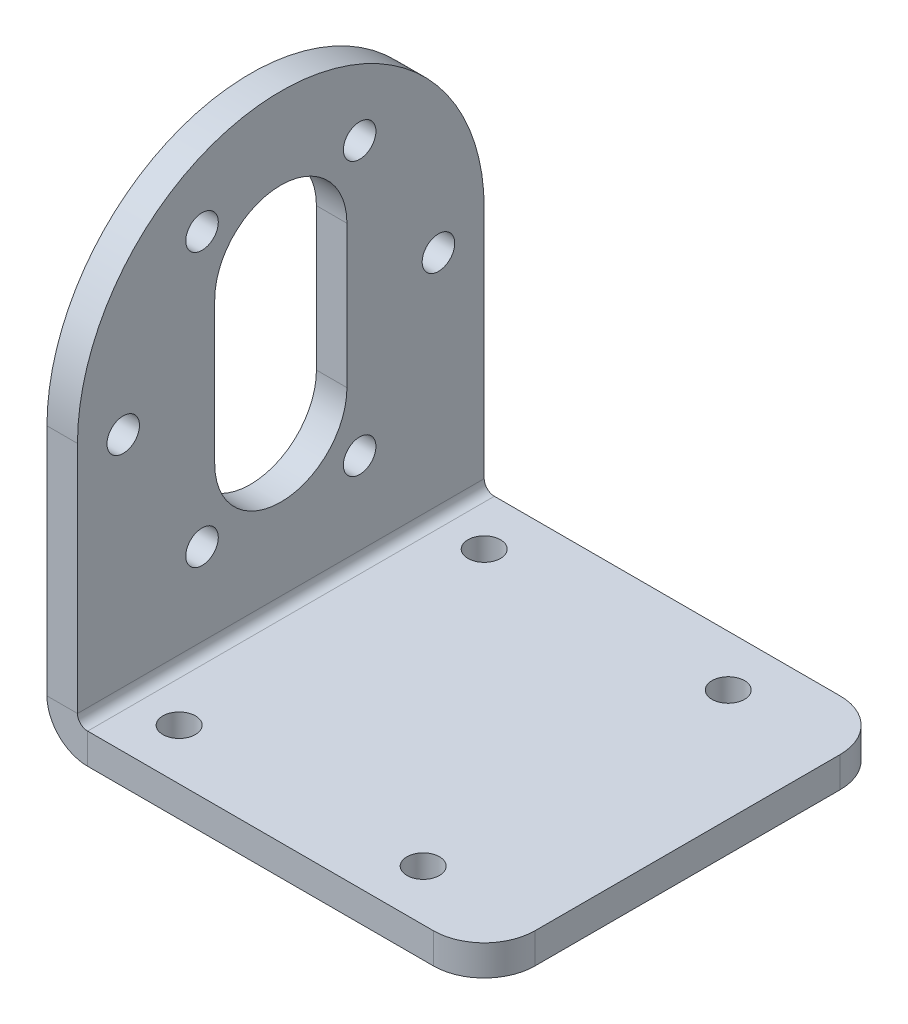
ISO-10303-21;
HEADER;
FILE_DESCRIPTION(('STEP AP214'),'2;1');
FILE_NAME('part.step','',(''),(''),'','','');
FILE_SCHEMA(('AUTOMOTIVE_DESIGN { 1 0 10303 214 1 1 1 1 }'));
ENDSEC;
DATA;
#1=APPLICATION_CONTEXT('core data for automotive mechanical design processes');
#2=APPLICATION_PROTOCOL_DEFINITION('international standard','automotive_design',2000,#1);
#3=PRODUCT_CONTEXT('',#1,'mechanical');
#4=PRODUCT('Part','Part','',(#3));
#5=PRODUCT_RELATED_PRODUCT_CATEGORY('part','',(#4));
#6=PRODUCT_DEFINITION_FORMATION('','',#4);
#7=PRODUCT_DEFINITION_CONTEXT('part definition',#1,'design');
#8=PRODUCT_DEFINITION('design','',#6,#7);
#9=PRODUCT_DEFINITION_SHAPE('','',#8);
#10=(LENGTH_UNIT() NAMED_UNIT(*) SI_UNIT(.MILLI.,.METRE.));
#11=(NAMED_UNIT(*) PLANE_ANGLE_UNIT() SI_UNIT($,.RADIAN.));
#12=(NAMED_UNIT(*) SI_UNIT($,.STERADIAN.) SOLID_ANGLE_UNIT());
#13=UNCERTAINTY_MEASURE_WITH_UNIT(LENGTH_MEASURE(1.E-05),#10,'distance_accuracy_value','');
#14=(GEOMETRIC_REPRESENTATION_CONTEXT(3) GLOBAL_UNCERTAINTY_ASSIGNED_CONTEXT((#13)) GLOBAL_UNIT_ASSIGNED_CONTEXT((#10,
#11,#12)) REPRESENTATION_CONTEXT('',''));
#15=CARTESIAN_POINT('',(0.,0.,0.));
#16=DIRECTION('',(0.,0.,1.));
#17=DIRECTION('',(1.,0.,0.));
#18=AXIS2_PLACEMENT_3D('',#15,#16,#17);
#19=CARTESIAN_POINT('',(7.99999999999999,47.,5.));
#20=DIRECTION('',(0.,-1.,0.));
#21=DIRECTION('',(0.,0.,-1.));
#22=AXIS2_PLACEMENT_3D('',#19,#20,#21);
#23=CYLINDRICAL_SURFACE('',#22,1.6);
#24=CARTESIAN_POINT('',(7.99999999999999,3.,5.));
#25=DIRECTION('',(0.,1.,0.));
#26=DIRECTION('',(0.,0.,1.));
#27=AXIS2_PLACEMENT_3D('',#24,#25,#26);
#28=CIRCLE('',#27,1.6);
#29=CARTESIAN_POINT('',(7.99999999999999,3.,6.6));
#30=VERTEX_POINT('',#29);
#31=EDGE_CURVE('E262',#30,#30,#28,.T.);
#32=ORIENTED_EDGE('',*,*,#31,.T.);
#33=EDGE_LOOP('',(#32));
#34=FACE_BOUND('',#33,.T.);
#35=CARTESIAN_POINT('',(7.99999999999999,0.,5.));
#36=DIRECTION('',(0.,-1.,0.));
#37=DIRECTION('',(0.,0.,-1.));
#38=AXIS2_PLACEMENT_3D('',#35,#36,#37);
#39=CIRCLE('',#38,1.6);
#40=CARTESIAN_POINT('',(7.99999999999999,0.,3.40000000000001));
#41=VERTEX_POINT('',#40);
#42=EDGE_CURVE('E265',#41,#41,#39,.T.);
#43=ORIENTED_EDGE('',*,*,#42,.T.);
#44=EDGE_LOOP('',(#43));
#45=FACE_BOUND('',#44,.T.);
#46=ADVANCED_FACE('F40',(#34,#45),#23,.F.);
#47=CARTESIAN_POINT('',(7.99999999999999,47.,35.));
#48=DIRECTION('',(0.,-1.,0.));
#49=DIRECTION('',(0.,0.,-1.));
#50=AXIS2_PLACEMENT_3D('',#47,#48,#49);
#51=CYLINDRICAL_SURFACE('',#50,1.6);
#52=CARTESIAN_POINT('',(7.99999999999999,3.,35.));
#53=DIRECTION('',(0.,1.,0.));
#54=DIRECTION('',(0.,0.,1.));
#55=AXIS2_PLACEMENT_3D('',#52,#53,#54);
#56=CIRCLE('',#55,1.6);
#57=CARTESIAN_POINT('',(7.99999999999999,3.,36.6));
#58=VERTEX_POINT('',#57);
#59=EDGE_CURVE('E251',#58,#58,#56,.T.);
#60=ORIENTED_EDGE('',*,*,#59,.T.);
#61=EDGE_LOOP('',(#60));
#62=FACE_BOUND('',#61,.T.);
#63=CARTESIAN_POINT('',(7.99999999999999,0.,35.));
#64=DIRECTION('',(0.,-1.,0.));
#65=DIRECTION('',(0.,0.,-1.));
#66=AXIS2_PLACEMENT_3D('',#63,#64,#65);
#67=CIRCLE('',#66,1.6);
#68=CARTESIAN_POINT('',(7.99999999999999,0.,33.4));
#69=VERTEX_POINT('',#68);
#70=EDGE_CURVE('E259',#69,#69,#67,.T.);
#71=ORIENTED_EDGE('',*,*,#70,.T.);
#72=EDGE_LOOP('',(#71));
#73=FACE_BOUND('',#72,.T.);
#74=ADVANCED_FACE('F346',(#62,#73),#51,.F.);
#75=CARTESIAN_POINT('',(3.,0.,40.));
#76=DIRECTION('',(1.,0.,0.));
#77=DIRECTION('',(0.,0.,-1.));
#78=AXIS2_PLACEMENT_3D('',#75,#76,#77);
#79=PLANE('',#78);
#80=CARTESIAN_POINT('',(3.,25.5,4.50000000000001));
#81=DIRECTION('',(1.,0.,0.));
#82=DIRECTION('',(0.,0.,-1.));
#83=AXIS2_PLACEMENT_3D('',#80,#81,#82);
#84=CIRCLE('',#83,1.6);
#85=CARTESIAN_POINT('',(3.,25.5,2.90000000000001));
#86=VERTEX_POINT('',#85);
#87=EDGE_CURVE('E707',#86,#86,#84,.T.);
#88=ORIENTED_EDGE('',*,*,#87,.F.);
#89=EDGE_LOOP('',(#88));
#90=FACE_BOUND('',#89,.T.);
#91=CARTESIAN_POINT('',(3.,38.9233937586588,12.25));
#92=DIRECTION('',(1.,0.,0.));
#93=DIRECTION('',(0.,0.,-1.));
#94=AXIS2_PLACEMENT_3D('',#91,#92,#93);
#95=CIRCLE('',#94,1.59999999999995);
#96=CARTESIAN_POINT('',(3.,38.9233937586588,10.6500000000001));
#97=VERTEX_POINT('',#96);
#98=EDGE_CURVE('E704',#97,#97,#95,.T.);
#99=ORIENTED_EDGE('',*,*,#98,.F.);
#100=EDGE_LOOP('',(#99));
#101=FACE_BOUND('',#100,.T.);
#102=CARTESIAN_POINT('',(3.,38.9233937586588,27.75));
#103=DIRECTION('',(1.,0.,0.));
#104=DIRECTION('',(0.,0.,-1.));
#105=AXIS2_PLACEMENT_3D('',#102,#103,#104);
#106=CIRCLE('',#105,1.60000000000001);
#107=CARTESIAN_POINT('',(3.,38.9233937586588,26.15));
#108=VERTEX_POINT('',#107);
#109=EDGE_CURVE('E701',#108,#108,#106,.T.);
#110=ORIENTED_EDGE('',*,*,#109,.F.);
#111=EDGE_LOOP('',(#110));
#112=FACE_BOUND('',#111,.T.);
#113=CARTESIAN_POINT('',(3.,25.5,35.5));
#114=DIRECTION('',(1.,0.,0.));
#115=DIRECTION('',(0.,0.,-1.));
#116=AXIS2_PLACEMENT_3D('',#113,#114,#115);
#117=CIRCLE('',#116,1.6);
#118=CARTESIAN_POINT('',(3.,25.5,33.9));
#119=VERTEX_POINT('',#118);
#120=EDGE_CURVE('E698',#119,#119,#117,.T.);
#121=ORIENTED_EDGE('',*,*,#120,.F.);
#122=EDGE_LOOP('',(#121));
#123=FACE_BOUND('',#122,.T.);
#124=CARTESIAN_POINT('',(3.,12.0766062413412,27.75));
#125=DIRECTION('',(1.,0.,0.));
#126=DIRECTION('',(0.,0.,-1.));
#127=AXIS2_PLACEMENT_3D('',#124,#125,#126);
#128=CIRCLE('',#127,1.6);
#129=CARTESIAN_POINT('',(3.,12.0766062413412,26.15));
#130=VERTEX_POINT('',#129);
#131=EDGE_CURVE('E695',#130,#130,#128,.T.);
#132=ORIENTED_EDGE('',*,*,#131,.F.);
#133=EDGE_LOOP('',(#132));
#134=FACE_BOUND('',#133,.T.);
#135=CARTESIAN_POINT('',(3.,12.0766062413412,12.25));
#136=DIRECTION('',(1.,0.,0.));
#137=DIRECTION('',(0.,0.,-1.));
#138=AXIS2_PLACEMENT_3D('',#135,#136,#137);
#139=CIRCLE('',#138,1.6);
#140=CARTESIAN_POINT('',(3.,12.0766062413412,10.65));
#141=VERTEX_POINT('',#140);
#142=EDGE_CURVE('E686',#141,#141,#139,.T.);
#143=ORIENTED_EDGE('',*,*,#142,.F.);
#144=EDGE_LOOP('',(#143));
#145=FACE_BOUND('',#144,.T.);
#146=CARTESIAN_POINT('',(3.,32.5,20.));
#147=DIRECTION('',(1.,0.,0.));
#148=DIRECTION('',(0.,0.,-1.));
#149=AXIS2_PLACEMENT_3D('',#146,#147,#148);
#150=CIRCLE('',#149,6.5);
#151=CARTESIAN_POINT('',(3.,32.5,13.5));
#152=VERTEX_POINT('',#151);
#153=CARTESIAN_POINT('',(3.,32.5,26.5));
#154=VERTEX_POINT('',#153);
#155=EDGE_CURVE('E183',#152,#154,#150,.T.);
#156=ORIENTED_EDGE('',*,*,#155,.F.);
#157=DIRECTION('',(0.,1.,0.));
#158=VECTOR('',#157,1.);
#159=CARTESIAN_POINT('',(3.,0.,13.5));
#160=LINE('',#159,#158);
#161=CARTESIAN_POINT('',(3.,18.5,13.5));
#162=VERTEX_POINT('',#161);
#163=EDGE_CURVE('E176',#162,#152,#160,.T.);
#164=ORIENTED_EDGE('',*,*,#163,.F.);
#165=CARTESIAN_POINT('',(3.,18.5,20.));
#166=DIRECTION('',(1.,0.,0.));
#167=DIRECTION('',(0.,0.,-1.));
#168=AXIS2_PLACEMENT_3D('',#165,#166,#167);
#169=CIRCLE('',#168,6.5);
#170=CARTESIAN_POINT('',(3.,18.5,26.5));
#171=VERTEX_POINT('',#170);
#172=EDGE_CURVE('E151',#171,#162,#169,.T.);
#173=ORIENTED_EDGE('',*,*,#172,.F.);
#174=DIRECTION('',(0.,-1.,0.));
#175=VECTOR('',#174,1.);
#176=CARTESIAN_POINT('',(3.,0.,26.5));
#177=LINE('',#176,#175);
#178=EDGE_CURVE('E181',#154,#171,#177,.T.);
#179=ORIENTED_EDGE('',*,*,#178,.F.);
#180=EDGE_LOOP('',(#156,#164,#173,#179));
#181=FACE_BOUND('',#180,.T.);
#182=CARTESIAN_POINT('',(3.,27.,20.));
#183=DIRECTION('',(1.,0.,0.));
#184=DIRECTION('',(0.,0.,-1.));
#185=AXIS2_PLACEMENT_3D('',#182,#183,#184);
#186=CIRCLE('',#185,20.);
#187=CARTESIAN_POINT('',(3.,27.,40.));
#188=VERTEX_POINT('',#187);
#189=CARTESIAN_POINT('',(3.,27.,0.));
#190=VERTEX_POINT('',#189);
#191=EDGE_CURVE('E190',#188,#190,#186,.F.);
#192=ORIENTED_EDGE('',*,*,#191,.F.);
#193=DIRECTION('',(0.,1.,0.));
#194=VECTOR('',#193,1.);
#195=CARTESIAN_POINT('',(3.,0.,40.));
#196=LINE('',#195,#194);
#197=CARTESIAN_POINT('',(3.,4.,40.));
#198=VERTEX_POINT('',#197);
#199=EDGE_CURVE('E201',#188,#198,#196,.F.);
#200=ORIENTED_EDGE('',*,*,#199,.T.);
#201=DIRECTION('',(0.,0.,-1.));
#202=VECTOR('',#201,1.);
#203=CARTESIAN_POINT('',(3.,4.,40.));
#204=LINE('',#203,#202);
#205=CARTESIAN_POINT('',(3.,4.,0.));
#206=VERTEX_POINT('',#205);
#207=EDGE_CURVE('E228',#198,#206,#204,.T.);
#208=ORIENTED_EDGE('',*,*,#207,.T.);
#209=DIRECTION('',(0.,1.,0.));
#210=VECTOR('',#209,1.);
#211=CARTESIAN_POINT('',(3.,0.,0.));
#212=LINE('',#211,#210);
#213=EDGE_CURVE('E217',#190,#206,#212,.F.);
#214=ORIENTED_EDGE('',*,*,#213,.F.);
#215=EDGE_LOOP('',(#192,#200,#208,#214));
#216=FACE_BOUND('',#215,.T.);
#217=ADVANCED_FACE('F321',(#90,#101,#112,#123,#134,#145,#181,#216),#79,.T.);
#218=CARTESIAN_POINT('',(0.,0.,40.));
#219=DIRECTION('',(1.,0.,0.));
#220=DIRECTION('',(0.,0.,-1.));
#221=AXIS2_PLACEMENT_3D('',#218,#219,#220);
#222=PLANE('',#221);
#223=CARTESIAN_POINT('',(0.,25.5,4.50000000000001));
#224=DIRECTION('',(-1.,0.,0.));
#225=DIRECTION('',(0.,0.,1.));
#226=AXIS2_PLACEMENT_3D('',#223,#224,#225);
#227=CIRCLE('',#226,1.6);
#228=CARTESIAN_POINT('',(0.,25.5,6.10000000000001));
#229=VERTEX_POINT('',#228);
#230=EDGE_CURVE('E665',#229,#229,#227,.T.);
#231=ORIENTED_EDGE('',*,*,#230,.F.);
#232=EDGE_LOOP('',(#231));
#233=FACE_BOUND('',#232,.T.);
#234=CARTESIAN_POINT('',(0.,38.9233937586588,12.25));
#235=DIRECTION('',(-1.,0.,0.));
#236=DIRECTION('',(0.,0.,1.));
#237=AXIS2_PLACEMENT_3D('',#234,#235,#236);
#238=CIRCLE('',#237,1.59999999999995);
#239=CARTESIAN_POINT('',(0.,38.9233937586588,13.85));
#240=VERTEX_POINT('',#239);
#241=EDGE_CURVE('E255',#240,#240,#238,.T.);
#242=ORIENTED_EDGE('',*,*,#241,.F.);
#243=EDGE_LOOP('',(#242));
#244=FACE_BOUND('',#243,.T.);
#245=CARTESIAN_POINT('',(0.,38.9233937586588,27.75));
#246=DIRECTION('',(-1.,0.,0.));
#247=DIRECTION('',(0.,0.,1.));
#248=AXIS2_PLACEMENT_3D('',#245,#246,#247);
#249=CIRCLE('',#248,1.60000000000001);
#250=CARTESIAN_POINT('',(0.,38.9233937586588,29.35));
#251=VERTEX_POINT('',#250);
#252=EDGE_CURVE('E672',#251,#251,#249,.T.);
#253=ORIENTED_EDGE('',*,*,#252,.F.);
#254=EDGE_LOOP('',(#253));
#255=FACE_BOUND('',#254,.T.);
#256=CARTESIAN_POINT('',(0.,25.5,35.5));
#257=DIRECTION('',(-1.,0.,0.));
#258=DIRECTION('',(0.,0.,1.));
#259=AXIS2_PLACEMENT_3D('',#256,#257,#258);
#260=CIRCLE('',#259,1.6);
#261=CARTESIAN_POINT('',(0.,25.5,37.1));
#262=VERTEX_POINT('',#261);
#263=EDGE_CURVE('E676',#262,#262,#260,.T.);
#264=ORIENTED_EDGE('',*,*,#263,.F.);
#265=EDGE_LOOP('',(#264));
#266=FACE_BOUND('',#265,.T.);
#267=CARTESIAN_POINT('',(0.,12.0766062413412,27.75));
#268=DIRECTION('',(-1.,0.,0.));
#269=DIRECTION('',(0.,0.,1.));
#270=AXIS2_PLACEMENT_3D('',#267,#268,#269);
#271=CIRCLE('',#270,1.6);
#272=CARTESIAN_POINT('',(0.,12.0766062413412,29.35));
#273=VERTEX_POINT('',#272);
#274=EDGE_CURVE('E680',#273,#273,#271,.T.);
#275=ORIENTED_EDGE('',*,*,#274,.F.);
#276=EDGE_LOOP('',(#275));
#277=FACE_BOUND('',#276,.T.);
#278=CARTESIAN_POINT('',(0.,12.0766062413412,12.25));
#279=DIRECTION('',(-1.,0.,0.));
#280=DIRECTION('',(0.,0.,1.));
#281=AXIS2_PLACEMENT_3D('',#278,#279,#280);
#282=CIRCLE('',#281,1.6);
#283=CARTESIAN_POINT('',(0.,12.0766062413412,13.85));
#284=VERTEX_POINT('',#283);
#285=EDGE_CURVE('E683',#284,#284,#282,.T.);
#286=ORIENTED_EDGE('',*,*,#285,.F.);
#287=EDGE_LOOP('',(#286));
#288=FACE_BOUND('',#287,.T.);
#289=DIRECTION('',(0.,-1.,0.));
#290=VECTOR('',#289,1.);
#291=CARTESIAN_POINT('',(0.,32.5,13.5));
#292=LINE('',#291,#290);
#293=CARTESIAN_POINT('',(0.,32.5,13.5));
#294=VERTEX_POINT('',#293);
#295=CARTESIAN_POINT('',(0.,18.5,13.5));
#296=VERTEX_POINT('',#295);
#297=EDGE_CURVE('E159',#294,#296,#292,.T.);
#298=ORIENTED_EDGE('',*,*,#297,.F.);
#299=CARTESIAN_POINT('',(0.,32.5,20.));
#300=DIRECTION('',(-1.,0.,0.));
#301=DIRECTION('',(0.,0.,1.));
#302=AXIS2_PLACEMENT_3D('',#299,#300,#301);
#303=CIRCLE('',#302,6.5);
#304=CARTESIAN_POINT('',(0.,32.5,26.5));
#305=VERTEX_POINT('',#304);
#306=EDGE_CURVE('E164',#305,#294,#303,.T.);
#307=ORIENTED_EDGE('',*,*,#306,.F.);
#308=DIRECTION('',(0.,1.,0.));
#309=VECTOR('',#308,1.);
#310=CARTESIAN_POINT('',(0.,32.5,26.5));
#311=LINE('',#310,#309);
#312=CARTESIAN_POINT('',(0.,18.5,26.5));
#313=VERTEX_POINT('',#312);
#314=EDGE_CURVE('E169',#313,#305,#311,.T.);
#315=ORIENTED_EDGE('',*,*,#314,.F.);
#316=CARTESIAN_POINT('',(0.,18.5,20.));
#317=DIRECTION('',(-1.,0.,0.));
#318=DIRECTION('',(0.,0.,1.));
#319=AXIS2_PLACEMENT_3D('',#316,#317,#318);
#320=CIRCLE('',#319,6.5);
#321=EDGE_CURVE('E148',#296,#313,#320,.T.);
#322=ORIENTED_EDGE('',*,*,#321,.F.);
#323=EDGE_LOOP('',(#298,#307,#315,#322));
#324=FACE_BOUND('',#323,.T.);
#325=DIRECTION('',(0.,-1.,0.));
#326=VECTOR('',#325,1.);
#327=CARTESIAN_POINT('',(0.,0.,40.));
#328=LINE('',#327,#326);
#329=CARTESIAN_POINT('',(0.,27.,40.));
#330=VERTEX_POINT('',#329);
#331=CARTESIAN_POINT('',(0.,4.,40.));
#332=VERTEX_POINT('',#331);
#333=EDGE_CURVE('E203',#330,#332,#328,.T.);
#334=ORIENTED_EDGE('',*,*,#333,.F.);
#335=CARTESIAN_POINT('',(0.,27.,20.));
#336=DIRECTION('',(-1.,0.,0.));
#337=DIRECTION('',(0.,0.,1.));
#338=AXIS2_PLACEMENT_3D('',#335,#336,#337);
#339=CIRCLE('',#338,20.);
#340=CARTESIAN_POINT('',(0.,27.,0.));
#341=VERTEX_POINT('',#340);
#342=EDGE_CURVE('E188',#341,#330,#339,.F.);
#343=ORIENTED_EDGE('',*,*,#342,.F.);
#344=DIRECTION('',(0.,-1.,0.));
#345=VECTOR('',#344,1.);
#346=CARTESIAN_POINT('',(0.,0.,0.));
#347=LINE('',#346,#345);
#348=CARTESIAN_POINT('',(0.,4.,0.));
#349=VERTEX_POINT('',#348);
#350=EDGE_CURVE('E219',#341,#349,#347,.T.);
#351=ORIENTED_EDGE('',*,*,#350,.T.);
#352=DIRECTION('',(0.,0.,-1.));
#353=VECTOR('',#352,1.);
#354=CARTESIAN_POINT('',(0.,4.,40.));
#355=LINE('',#354,#353);
#356=EDGE_CURVE('E225',#332,#349,#355,.T.);
#357=ORIENTED_EDGE('',*,*,#356,.F.);
#358=EDGE_LOOP('',(#334,#343,#351,#357));
#359=FACE_BOUND('',#358,.T.);
#360=ADVANCED_FACE('F166',(#233,#244,#255,#266,#277,#288,#324,#359),#222,.F.);
#361=CARTESIAN_POINT('',(0.,4.,40.));
#362=DIRECTION('',(0.,0.,1.));
#363=DIRECTION('',(1.,0.,0.));
#364=AXIS2_PLACEMENT_3D('',#361,#362,#363);
#365=PLANE('',#364);
#366=DIRECTION('',(1.,0.,0.));
#367=VECTOR('',#366,1.);
#368=CARTESIAN_POINT('',(0.,4.,40.));
#369=LINE('',#368,#367);
#370=EDGE_CURVE('E245',#332,#198,#369,.T.);
#371=ORIENTED_EDGE('',*,*,#370,.F.);
#372=CARTESIAN_POINT('',(4.,4.,40.));
#373=DIRECTION('',(0.,0.,-1.));
#374=DIRECTION('',(-1.,0.,0.));
#375=AXIS2_PLACEMENT_3D('',#372,#373,#374);
#376=CIRCLE('',#375,4.);
#377=CARTESIAN_POINT('',(4.,0.,40.));
#378=VERTEX_POINT('',#377);
#379=EDGE_CURVE('E205',#332,#378,#376,.F.);
#380=ORIENTED_EDGE('',*,*,#379,.T.);
#381=DIRECTION('',(0.,-1.,0.));
#382=VECTOR('',#381,1.);
#383=CARTESIAN_POINT('',(4.,3.,40.));
#384=LINE('',#383,#382);
#385=CARTESIAN_POINT('',(4.,3.,40.));
#386=VERTEX_POINT('',#385);
#387=EDGE_CURVE('E243',#386,#378,#384,.T.);
#388=ORIENTED_EDGE('',*,*,#387,.F.);
#389=CARTESIAN_POINT('',(4.,4.,40.));
#390=DIRECTION('',(0.,0.,1.));
#391=DIRECTION('',(1.,0.,0.));
#392=AXIS2_PLACEMENT_3D('',#389,#390,#391);
#393=CIRCLE('',#392,1.);
#394=EDGE_CURVE('E198',#198,#386,#393,.T.);
#395=ORIENTED_EDGE('',*,*,#394,.F.);
#396=EDGE_LOOP('',(#371,#380,#388,#395));
#397=FACE_BOUND('',#396,.T.);
#398=ADVANCED_FACE('F307',(#397),#365,.T.);
#399=CARTESIAN_POINT('',(4.,3.,40.));
#400=DIRECTION('',(0.,0.,1.));
#401=DIRECTION('',(1.,0.,0.));
#402=AXIS2_PLACEMENT_3D('',#399,#400,#401);
#403=PLANE('',#402);
#404=DIRECTION('',(-1.,0.,0.));
#405=VECTOR('',#404,1.);
#406=CARTESIAN_POINT('',(10.,27.,40.));
#407=LINE('',#406,#405);
#408=EDGE_CURVE('E185',#188,#330,#407,.T.);
#409=ORIENTED_EDGE('',*,*,#408,.T.);
#410=ORIENTED_EDGE('',*,*,#333,.T.);
#411=ORIENTED_EDGE('',*,*,#370,.T.);
#412=ORIENTED_EDGE('',*,*,#199,.F.);
#413=EDGE_LOOP('',(#409,#410,#411,#412));
#414=FACE_BOUND('',#413,.T.);
#415=ADVANCED_FACE('F325',(#414),#403,.T.);
#416=CARTESIAN_POINT('',(4.,0.,0.));
#417=DIRECTION('',(0.,0.,-1.));
#418=DIRECTION('',(-1.,0.,0.));
#419=AXIS2_PLACEMENT_3D('',#416,#417,#418);
#420=PLANE('',#419);
#421=DIRECTION('',(0.,1.,0.));
#422=VECTOR('',#421,1.);
#423=CARTESIAN_POINT('',(4.,0.,0.));
#424=LINE('',#423,#422);
#425=CARTESIAN_POINT('',(4.,0.,0.));
#426=VERTEX_POINT('',#425);
#427=CARTESIAN_POINT('',(4.,3.,0.));
#428=VERTEX_POINT('',#427);
#429=EDGE_CURVE('E241',#426,#428,#424,.T.);
#430=ORIENTED_EDGE('',*,*,#429,.F.);
#431=CARTESIAN_POINT('',(4.,4.,0.));
#432=DIRECTION('',(0.,0.,-1.));
#433=DIRECTION('',(-1.,0.,0.));
#434=AXIS2_PLACEMENT_3D('',#431,#432,#433);
#435=CIRCLE('',#434,4.);
#436=EDGE_CURVE('E196',#349,#426,#435,.F.);
#437=ORIENTED_EDGE('',*,*,#436,.F.);
#438=DIRECTION('',(-1.,0.,0.));
#439=VECTOR('',#438,1.);
#440=CARTESIAN_POINT('',(3.,4.,0.));
#441=LINE('',#440,#439);
#442=EDGE_CURVE('E238',#206,#349,#441,.T.);
#443=ORIENTED_EDGE('',*,*,#442,.F.);
#444=CARTESIAN_POINT('',(4.,4.,0.));
#445=DIRECTION('',(0.,0.,1.));
#446=DIRECTION('',(1.,0.,0.));
#447=AXIS2_PLACEMENT_3D('',#444,#445,#446);
#448=CIRCLE('',#447,1.);
#449=EDGE_CURVE('E214',#206,#428,#448,.T.);
#450=ORIENTED_EDGE('',*,*,#449,.T.);
#451=EDGE_LOOP('',(#430,#437,#443,#450));
#452=FACE_BOUND('',#451,.T.);
#453=ADVANCED_FACE('F314',(#452),#420,.T.);
#454=CARTESIAN_POINT('',(3.,4.,0.));
#455=DIRECTION('',(0.,0.,-1.));
#456=DIRECTION('',(-1.,0.,0.));
#457=AXIS2_PLACEMENT_3D('',#454,#455,#456);
#458=PLANE('',#457);
#459=DIRECTION('',(1.,0.,0.));
#460=VECTOR('',#459,1.);
#461=CARTESIAN_POINT('',(0.,3.,0.));
#462=LINE('',#461,#460);
#463=CARTESIAN_POINT('',(38.,3.,0.));
#464=VERTEX_POINT('',#463);
#465=EDGE_CURVE('E211',#428,#464,#462,.T.);
#466=ORIENTED_EDGE('',*,*,#465,.T.);
#467=DIRECTION('',(0.,-1.,0.));
#468=VECTOR('',#467,1.);
#469=CARTESIAN_POINT('',(38.,4.,0.));
#470=LINE('',#469,#468);
#471=CARTESIAN_POINT('',(38.,0.,0.));
#472=VERTEX_POINT('',#471);
#473=EDGE_CURVE('E268',#464,#472,#470,.T.);
#474=ORIENTED_EDGE('',*,*,#473,.T.);
#475=DIRECTION('',(1.,0.,0.));
#476=VECTOR('',#475,1.);
#477=CARTESIAN_POINT('',(0.,0.,0.));
#478=LINE('',#477,#476);
#479=EDGE_CURVE('E192',#426,#472,#478,.T.);
#480=ORIENTED_EDGE('',*,*,#479,.F.);
#481=ORIENTED_EDGE('',*,*,#429,.T.);
#482=EDGE_LOOP('',(#466,#474,#480,#481));
#483=FACE_BOUND('',#482,.T.);
#484=ADVANCED_FACE('F289',(#483),#458,.T.);
#485=CARTESIAN_POINT('',(0.,0.,40.));
#486=DIRECTION('',(0.,1.,0.));
#487=DIRECTION('',(0.,0.,1.));
#488=AXIS2_PLACEMENT_3D('',#485,#486,#487);
#489=PLANE('',#488);
#490=CARTESIAN_POINT('',(32.,0.,5.));
#491=DIRECTION('',(0.,-1.,0.));
#492=DIRECTION('',(0.,0.,-1.));
#493=AXIS2_PLACEMENT_3D('',#490,#491,#492);
#494=CIRCLE('',#493,1.6);
#495=CARTESIAN_POINT('',(32.,0.,3.40000000000001));
#496=VERTEX_POINT('',#495);
#497=EDGE_CURVE('E732',#496,#496,#494,.T.);
#498=ORIENTED_EDGE('',*,*,#497,.F.);
#499=EDGE_LOOP('',(#498));
#500=FACE_BOUND('',#499,.T.);
#501=CARTESIAN_POINT('',(32.,0.,35.));
#502=DIRECTION('',(0.,-1.,0.));
#503=DIRECTION('',(0.,0.,-1.));
#504=AXIS2_PLACEMENT_3D('',#501,#502,#503);
#505=CIRCLE('',#504,1.6);
#506=CARTESIAN_POINT('',(32.,0.,33.4));
#507=VERTEX_POINT('',#506);
#508=EDGE_CURVE('E256',#507,#507,#505,.T.);
#509=ORIENTED_EDGE('',*,*,#508,.F.);
#510=EDGE_LOOP('',(#509));
#511=FACE_BOUND('',#510,.T.);
#512=ORIENTED_EDGE('',*,*,#479,.T.);
#513=CARTESIAN_POINT('',(38.,0.,5.));
#514=DIRECTION('',(0.,1.,0.));
#515=DIRECTION('',(0.,0.,1.));
#516=AXIS2_PLACEMENT_3D('',#513,#514,#515);
#517=CIRCLE('',#516,5.);
#518=CARTESIAN_POINT('',(43.,0.,5.));
#519=VERTEX_POINT('',#518);
#520=EDGE_CURVE('E273',#472,#519,#517,.F.);
#521=ORIENTED_EDGE('',*,*,#520,.T.);
#522=DIRECTION('',(0.,0.,-1.));
#523=VECTOR('',#522,1.);
#524=CARTESIAN_POINT('',(43.,0.,40.));
#525=LINE('',#524,#523);
#526=CARTESIAN_POINT('',(43.,0.,35.));
#527=VERTEX_POINT('',#526);
#528=EDGE_CURVE('E236',#527,#519,#525,.T.);
#529=ORIENTED_EDGE('',*,*,#528,.F.);
#530=CARTESIAN_POINT('',(38.,0.,35.));
#531=DIRECTION('',(0.,1.,0.));
#532=DIRECTION('',(0.,0.,1.));
#533=AXIS2_PLACEMENT_3D('',#530,#531,#532);
#534=CIRCLE('',#533,5.);
#535=CARTESIAN_POINT('',(38.,0.,40.));
#536=VERTEX_POINT('',#535);
#537=EDGE_CURVE('E271',#527,#536,#534,.F.);
#538=ORIENTED_EDGE('',*,*,#537,.T.);
#539=DIRECTION('',(1.,0.,0.));
#540=VECTOR('',#539,1.);
#541=CARTESIAN_POINT('',(0.,0.,40.));
#542=LINE('',#541,#540);
#543=EDGE_CURVE('E193',#378,#536,#542,.T.);
#544=ORIENTED_EDGE('',*,*,#543,.F.);
#545=DIRECTION('',(0.,0.,-1.));
#546=VECTOR('',#545,1.);
#547=CARTESIAN_POINT('',(4.,0.,40.));
#548=LINE('',#547,#546);
#549=EDGE_CURVE('E208',#378,#426,#548,.T.);
#550=ORIENTED_EDGE('',*,*,#549,.T.);
#551=EDGE_LOOP('',(#512,#521,#529,#538,#544,#550));
#552=FACE_BOUND('',#551,.T.);
#553=ORIENTED_EDGE('',*,*,#70,.F.);
#554=EDGE_LOOP('',(#553));
#555=FACE_BOUND('',#554,.T.);
#556=ORIENTED_EDGE('',*,*,#42,.F.);
#557=EDGE_LOOP('',(#556));
#558=FACE_BOUND('',#557,.T.);
#559=ADVANCED_FACE('F294',(#500,#511,#552,#555,#558),#489,.F.);
#560=CARTESIAN_POINT('',(43.,3.,40.));
#561=DIRECTION('',(1.,0.,0.));
#562=DIRECTION('',(0.,0.,-1.));
#563=AXIS2_PLACEMENT_3D('',#560,#561,#562);
#564=PLANE('',#563);
#565=ORIENTED_EDGE('',*,*,#528,.T.);
#566=DIRECTION('',(0.,-1.,0.));
#567=VECTOR('',#566,1.);
#568=CARTESIAN_POINT('',(43.,3.,5.));
#569=LINE('',#568,#567);
#570=CARTESIAN_POINT('',(43.,3.,5.));
#571=VERTEX_POINT('',#570);
#572=EDGE_CURVE('E61',#519,#571,#569,.F.);
#573=ORIENTED_EDGE('',*,*,#572,.T.);
#574=DIRECTION('',(0.,0.,-1.));
#575=VECTOR('',#574,1.);
#576=CARTESIAN_POINT('',(43.,3.,40.));
#577=LINE('',#576,#575);
#578=CARTESIAN_POINT('',(43.,3.,35.));
#579=VERTEX_POINT('',#578);
#580=EDGE_CURVE('E234',#579,#571,#577,.T.);
#581=ORIENTED_EDGE('',*,*,#580,.F.);
#582=DIRECTION('',(0.,-1.,0.));
#583=VECTOR('',#582,1.);
#584=CARTESIAN_POINT('',(43.,3.,35.));
#585=LINE('',#584,#583);
#586=EDGE_CURVE('E275',#579,#527,#585,.T.);
#587=ORIENTED_EDGE('',*,*,#586,.T.);
#588=EDGE_LOOP('',(#565,#573,#581,#587));
#589=FACE_BOUND('',#588,.T.);
#590=ADVANCED_FACE('F296',(#589),#564,.T.);
#591=CARTESIAN_POINT('',(0.,3.,40.));
#592=DIRECTION('',(0.,1.,0.));
#593=DIRECTION('',(0.,0.,1.));
#594=AXIS2_PLACEMENT_3D('',#591,#592,#593);
#595=PLANE('',#594);
#596=CARTESIAN_POINT('',(32.,3.,5.));
#597=DIRECTION('',(0.,1.,0.));
#598=DIRECTION('',(0.,0.,1.));
#599=AXIS2_PLACEMENT_3D('',#596,#597,#598);
#600=CIRCLE('',#599,1.6);
#601=CARTESIAN_POINT('',(32.,3.,6.6));
#602=VERTEX_POINT('',#601);
#603=EDGE_CURVE('E735',#602,#602,#600,.T.);
#604=ORIENTED_EDGE('',*,*,#603,.F.);
#605=EDGE_LOOP('',(#604));
#606=FACE_BOUND('',#605,.T.);
#607=CARTESIAN_POINT('',(32.,3.,35.));
#608=DIRECTION('',(0.,1.,0.));
#609=DIRECTION('',(0.,0.,1.));
#610=AXIS2_PLACEMENT_3D('',#607,#608,#609);
#611=CIRCLE('',#610,1.6);
#612=CARTESIAN_POINT('',(32.,3.,36.6));
#613=VERTEX_POINT('',#612);
#614=EDGE_CURVE('E252',#613,#613,#611,.T.);
#615=ORIENTED_EDGE('',*,*,#614,.F.);
#616=EDGE_LOOP('',(#615));
#617=FACE_BOUND('',#616,.T.);
#618=ORIENTED_EDGE('',*,*,#580,.T.);
#619=CARTESIAN_POINT('',(38.,3.,5.));
#620=DIRECTION('',(0.,1.,0.));
#621=DIRECTION('',(0.,0.,1.));
#622=AXIS2_PLACEMENT_3D('',#619,#620,#621);
#623=CIRCLE('',#622,5.);
#624=EDGE_CURVE('E48',#571,#464,#623,.T.);
#625=ORIENTED_EDGE('',*,*,#624,.T.);
#626=ORIENTED_EDGE('',*,*,#465,.F.);
#627=DIRECTION('',(0.,0.,-1.));
#628=VECTOR('',#627,1.);
#629=CARTESIAN_POINT('',(4.,3.,40.));
#630=LINE('',#629,#628);
#631=EDGE_CURVE('E231',#386,#428,#630,.T.);
#632=ORIENTED_EDGE('',*,*,#631,.F.);
#633=DIRECTION('',(1.,0.,0.));
#634=VECTOR('',#633,1.);
#635=CARTESIAN_POINT('',(0.,3.,40.));
#636=LINE('',#635,#634);
#637=CARTESIAN_POINT('',(38.,3.,40.));
#638=VERTEX_POINT('',#637);
#639=EDGE_CURVE('E195',#386,#638,#636,.T.);
#640=ORIENTED_EDGE('',*,*,#639,.T.);
#641=CARTESIAN_POINT('',(38.,3.,35.));
#642=DIRECTION('',(0.,1.,0.));
#643=DIRECTION('',(0.,0.,1.));
#644=AXIS2_PLACEMENT_3D('',#641,#642,#643);
#645=CIRCLE('',#644,5.);
#646=EDGE_CURVE('E279',#638,#579,#645,.T.);
#647=ORIENTED_EDGE('',*,*,#646,.T.);
#648=EDGE_LOOP('',(#618,#625,#626,#632,#640,#647));
#649=FACE_BOUND('',#648,.T.);
#650=ORIENTED_EDGE('',*,*,#59,.F.);
#651=EDGE_LOOP('',(#650));
#652=FACE_BOUND('',#651,.T.);
#653=ORIENTED_EDGE('',*,*,#31,.F.);
#654=EDGE_LOOP('',(#653));
#655=FACE_BOUND('',#654,.T.);
#656=ADVANCED_FACE('F283',(#606,#617,#649,#652,#655),#595,.T.);
#657=CARTESIAN_POINT('',(4.,4.,40.));
#658=DIRECTION('',(0.,0.,-1.));
#659=DIRECTION('',(-1.,0.,0.));
#660=AXIS2_PLACEMENT_3D('',#657,#658,#659);
#661=CYLINDRICAL_SURFACE('',#660,1.);
#662=ORIENTED_EDGE('',*,*,#449,.F.);
#663=ORIENTED_EDGE('',*,*,#207,.F.);
#664=ORIENTED_EDGE('',*,*,#394,.T.);
#665=ORIENTED_EDGE('',*,*,#631,.T.);
#666=EDGE_LOOP('',(#662,#663,#664,#665));
#667=FACE_BOUND('',#666,.T.);
#668=ADVANCED_FACE('F318',(#667),#661,.F.);
#669=CARTESIAN_POINT('',(4.,4.,40.));
#670=DIRECTION('',(0.,0.,-1.));
#671=DIRECTION('',(-1.,0.,0.));
#672=AXIS2_PLACEMENT_3D('',#669,#670,#671);
#673=CYLINDRICAL_SURFACE('',#672,4.);
#674=ORIENTED_EDGE('',*,*,#436,.T.);
#675=ORIENTED_EDGE('',*,*,#549,.F.);
#676=ORIENTED_EDGE('',*,*,#379,.F.);
#677=ORIENTED_EDGE('',*,*,#356,.T.);
#678=EDGE_LOOP('',(#674,#675,#676,#677));
#679=FACE_BOUND('',#678,.T.);
#680=ADVANCED_FACE('F310',(#679),#673,.T.);
#681=CARTESIAN_POINT('',(4.,4.,40.));
#682=DIRECTION('',(0.,0.,1.));
#683=DIRECTION('',(1.,0.,0.));
#684=AXIS2_PLACEMENT_3D('',#681,#682,#683);
#685=PLANE('',#684);
#686=ORIENTED_EDGE('',*,*,#543,.T.);
#687=DIRECTION('',(0.,-1.,0.));
#688=VECTOR('',#687,1.);
#689=CARTESIAN_POINT('',(38.,4.,40.));
#690=LINE('',#689,#688);
#691=EDGE_CURVE('E11',#536,#638,#690,.F.);
#692=ORIENTED_EDGE('',*,*,#691,.T.);
#693=ORIENTED_EDGE('',*,*,#639,.F.);
#694=ORIENTED_EDGE('',*,*,#387,.T.);
#695=EDGE_LOOP('',(#686,#692,#693,#694));
#696=FACE_BOUND('',#695,.T.);
#697=ADVANCED_FACE('F301',(#696),#685,.T.);
#698=CARTESIAN_POINT('',(4.,4.,0.));
#699=DIRECTION('',(0.,0.,1.));
#700=DIRECTION('',(1.,0.,0.));
#701=AXIS2_PLACEMENT_3D('',#698,#699,#700);
#702=PLANE('',#701);
#703=ORIENTED_EDGE('',*,*,#350,.F.);
#704=DIRECTION('',(-1.,0.,0.));
#705=VECTOR('',#704,1.);
#706=CARTESIAN_POINT('',(10.,27.,0.));
#707=LINE('',#706,#705);
#708=EDGE_CURVE('E248',#341,#190,#707,.F.);
#709=ORIENTED_EDGE('',*,*,#708,.T.);
#710=ORIENTED_EDGE('',*,*,#213,.T.);
#711=ORIENTED_EDGE('',*,*,#442,.T.);
#712=EDGE_LOOP('',(#703,#709,#710,#711));
#713=FACE_BOUND('',#712,.T.);
#714=ADVANCED_FACE('F330',(#713),#702,.F.);
#715=CARTESIAN_POINT('',(10.,27.,20.));
#716=DIRECTION('',(-1.,0.,0.));
#717=DIRECTION('',(0.,0.,1.));
#718=AXIS2_PLACEMENT_3D('',#715,#716,#717);
#719=CYLINDRICAL_SURFACE('',#718,20.);
#720=ORIENTED_EDGE('',*,*,#191,.T.);
#721=ORIENTED_EDGE('',*,*,#708,.F.);
#722=ORIENTED_EDGE('',*,*,#342,.T.);
#723=ORIENTED_EDGE('',*,*,#408,.F.);
#724=EDGE_LOOP('',(#720,#721,#722,#723));
#725=FACE_BOUND('',#724,.T.);
#726=ADVANCED_FACE('F332',(#725),#719,.T.);
#727=CARTESIAN_POINT('',(43.,32.5,20.));
#728=DIRECTION('',(-1.,0.,0.));
#729=DIRECTION('',(0.,0.,1.));
#730=AXIS2_PLACEMENT_3D('',#727,#728,#729);
#731=CYLINDRICAL_SURFACE('',#730,6.5);
#732=ORIENTED_EDGE('',*,*,#155,.T.);
#733=DIRECTION('',(-1.,0.,0.));
#734=VECTOR('',#733,1.);
#735=CARTESIAN_POINT('',(43.,32.5,26.5));
#736=LINE('',#735,#734);
#737=EDGE_CURVE('E174',#154,#305,#736,.T.);
#738=ORIENTED_EDGE('',*,*,#737,.T.);
#739=ORIENTED_EDGE('',*,*,#306,.T.);
#740=DIRECTION('',(-1.,0.,0.));
#741=VECTOR('',#740,1.);
#742=CARTESIAN_POINT('',(43.,32.5,13.5));
#743=LINE('',#742,#741);
#744=EDGE_CURVE('E155',#152,#294,#743,.T.);
#745=ORIENTED_EDGE('',*,*,#744,.F.);
#746=EDGE_LOOP('',(#732,#738,#739,#745));
#747=FACE_BOUND('',#746,.T.);
#748=ADVANCED_FACE('F334',(#747),#731,.F.);
#749=CARTESIAN_POINT('',(43.,32.5,26.5));
#750=DIRECTION('',(0.,0.,1.));
#751=DIRECTION('',(1.,0.,0.));
#752=AXIS2_PLACEMENT_3D('',#749,#750,#751);
#753=PLANE('',#752);
#754=ORIENTED_EDGE('',*,*,#178,.T.);
#755=DIRECTION('',(-1.,0.,0.));
#756=VECTOR('',#755,1.);
#757=CARTESIAN_POINT('',(43.,18.5,26.5));
#758=LINE('',#757,#756);
#759=EDGE_CURVE('E154',#171,#313,#758,.T.);
#760=ORIENTED_EDGE('',*,*,#759,.T.);
#761=ORIENTED_EDGE('',*,*,#314,.T.);
#762=ORIENTED_EDGE('',*,*,#737,.F.);
#763=EDGE_LOOP('',(#754,#760,#761,#762));
#764=FACE_BOUND('',#763,.T.);
#765=ADVANCED_FACE('F340',(#764),#753,.F.);
#766=CARTESIAN_POINT('',(43.,18.5,20.));
#767=DIRECTION('',(-1.,0.,0.));
#768=DIRECTION('',(0.,0.,1.));
#769=AXIS2_PLACEMENT_3D('',#766,#767,#768);
#770=CYLINDRICAL_SURFACE('',#769,6.5);
#771=ORIENTED_EDGE('',*,*,#172,.T.);
#772=DIRECTION('',(-1.,0.,0.));
#773=VECTOR('',#772,1.);
#774=CARTESIAN_POINT('',(43.,18.5,13.5));
#775=LINE('',#774,#773);
#776=EDGE_CURVE('E143',#162,#296,#775,.T.);
#777=ORIENTED_EDGE('',*,*,#776,.T.);
#778=ORIENTED_EDGE('',*,*,#321,.T.);
#779=ORIENTED_EDGE('',*,*,#759,.F.);
#780=EDGE_LOOP('',(#771,#777,#778,#779));
#781=FACE_BOUND('',#780,.T.);
#782=ADVANCED_FACE('F145',(#781),#770,.F.);
#783=CARTESIAN_POINT('',(43.,32.5,13.5));
#784=DIRECTION('',(0.,0.,-1.));
#785=DIRECTION('',(0.,1.,0.));
#786=AXIS2_PLACEMENT_3D('',#783,#784,#785);
#787=PLANE('',#786);
#788=ORIENTED_EDGE('',*,*,#163,.T.);
#789=ORIENTED_EDGE('',*,*,#744,.T.);
#790=ORIENTED_EDGE('',*,*,#297,.T.);
#791=ORIENTED_EDGE('',*,*,#776,.F.);
#792=EDGE_LOOP('',(#788,#789,#790,#791));
#793=FACE_BOUND('',#792,.T.);
#794=ADVANCED_FACE('F160',(#793),#787,.F.);
#795=CARTESIAN_POINT('',(43.,12.0766062413412,12.25));
#796=DIRECTION('',(-1.,0.,0.));
#797=DIRECTION('',(0.,0.,1.));
#798=AXIS2_PLACEMENT_3D('',#795,#796,#797);
#799=CYLINDRICAL_SURFACE('',#798,1.6);
#800=ORIENTED_EDGE('',*,*,#142,.T.);
#801=EDGE_LOOP('',(#800));
#802=FACE_BOUND('',#801,.T.);
#803=ORIENTED_EDGE('',*,*,#285,.T.);
#804=EDGE_LOOP('',(#803));
#805=FACE_BOUND('',#804,.T.);
#806=ADVANCED_FACE('F382',(#802,#805),#799,.F.);
#807=CARTESIAN_POINT('',(43.,12.0766062413412,27.75));
#808=DIRECTION('',(-1.,0.,0.));
#809=DIRECTION('',(0.,0.,1.));
#810=AXIS2_PLACEMENT_3D('',#807,#808,#809);
#811=CYLINDRICAL_SURFACE('',#810,1.6);
#812=ORIENTED_EDGE('',*,*,#131,.T.);
#813=EDGE_LOOP('',(#812));
#814=FACE_BOUND('',#813,.T.);
#815=ORIENTED_EDGE('',*,*,#274,.T.);
#816=EDGE_LOOP('',(#815));
#817=FACE_BOUND('',#816,.T.);
#818=ADVANCED_FACE('F385',(#814,#817),#811,.F.);
#819=CARTESIAN_POINT('',(43.,25.5,35.5));
#820=DIRECTION('',(-1.,0.,0.));
#821=DIRECTION('',(0.,0.,1.));
#822=AXIS2_PLACEMENT_3D('',#819,#820,#821);
#823=CYLINDRICAL_SURFACE('',#822,1.6);
#824=ORIENTED_EDGE('',*,*,#120,.T.);
#825=EDGE_LOOP('',(#824));
#826=FACE_BOUND('',#825,.T.);
#827=ORIENTED_EDGE('',*,*,#263,.T.);
#828=EDGE_LOOP('',(#827));
#829=FACE_BOUND('',#828,.T.);
#830=ADVANCED_FACE('F389',(#826,#829),#823,.F.);
#831=CARTESIAN_POINT('',(43.,38.9233937586588,27.75));
#832=DIRECTION('',(-1.,0.,0.));
#833=DIRECTION('',(0.,0.,1.));
#834=AXIS2_PLACEMENT_3D('',#831,#832,#833);
#835=CYLINDRICAL_SURFACE('',#834,1.60000000000001);
#836=ORIENTED_EDGE('',*,*,#109,.T.);
#837=EDGE_LOOP('',(#836));
#838=FACE_BOUND('',#837,.T.);
#839=ORIENTED_EDGE('',*,*,#252,.T.);
#840=EDGE_LOOP('',(#839));
#841=FACE_BOUND('',#840,.T.);
#842=ADVANCED_FACE('F380',(#838,#841),#835,.F.);
#843=CARTESIAN_POINT('',(43.,38.9233937586588,12.25));
#844=DIRECTION('',(-1.,0.,0.));
#845=DIRECTION('',(0.,0.,1.));
#846=AXIS2_PLACEMENT_3D('',#843,#844,#845);
#847=CYLINDRICAL_SURFACE('',#846,1.59999999999995);
#848=ORIENTED_EDGE('',*,*,#98,.T.);
#849=EDGE_LOOP('',(#848));
#850=FACE_BOUND('',#849,.T.);
#851=ORIENTED_EDGE('',*,*,#241,.T.);
#852=EDGE_LOOP('',(#851));
#853=FACE_BOUND('',#852,.T.);
#854=ADVANCED_FACE('F376',(#850,#853),#847,.F.);
#855=CARTESIAN_POINT('',(43.,25.5,4.50000000000001));
#856=DIRECTION('',(-1.,0.,0.));
#857=DIRECTION('',(0.,0.,1.));
#858=AXIS2_PLACEMENT_3D('',#855,#856,#857);
#859=CYLINDRICAL_SURFACE('',#858,1.6);
#860=ORIENTED_EDGE('',*,*,#87,.T.);
#861=EDGE_LOOP('',(#860));
#862=FACE_BOUND('',#861,.T.);
#863=ORIENTED_EDGE('',*,*,#230,.T.);
#864=EDGE_LOOP('',(#863));
#865=FACE_BOUND('',#864,.T.);
#866=ADVANCED_FACE('F368',(#862,#865),#859,.F.);
#867=CARTESIAN_POINT('',(32.,47.,35.));
#868=DIRECTION('',(0.,-1.,0.));
#869=DIRECTION('',(0.,0.,-1.));
#870=AXIS2_PLACEMENT_3D('',#867,#868,#869);
#871=CYLINDRICAL_SURFACE('',#870,1.6);
#872=ORIENTED_EDGE('',*,*,#614,.T.);
#873=EDGE_LOOP('',(#872));
#874=FACE_BOUND('',#873,.T.);
#875=ORIENTED_EDGE('',*,*,#508,.T.);
#876=EDGE_LOOP('',(#875));
#877=FACE_BOUND('',#876,.T.);
#878=ADVANCED_FACE('F362',(#874,#877),#871,.F.);
#879=CARTESIAN_POINT('',(32.,47.,5.));
#880=DIRECTION('',(0.,-1.,0.));
#881=DIRECTION('',(0.,0.,-1.));
#882=AXIS2_PLACEMENT_3D('',#879,#880,#881);
#883=CYLINDRICAL_SURFACE('',#882,1.6);
#884=ORIENTED_EDGE('',*,*,#603,.T.);
#885=EDGE_LOOP('',(#884));
#886=FACE_BOUND('',#885,.T.);
#887=ORIENTED_EDGE('',*,*,#497,.T.);
#888=EDGE_LOOP('',(#887));
#889=FACE_BOUND('',#888,.T.);
#890=ADVANCED_FACE('F357',(#886,#889),#883,.F.);
#891=CARTESIAN_POINT('',(38.,4.,5.));
#892=DIRECTION('',(0.,-1.,0.));
#893=DIRECTION('',(0.,0.,-1.));
#894=AXIS2_PLACEMENT_3D('',#891,#892,#893);
#895=CYLINDRICAL_SURFACE('',#894,5.);
#896=ORIENTED_EDGE('',*,*,#624,.F.);
#897=ORIENTED_EDGE('',*,*,#572,.F.);
#898=ORIENTED_EDGE('',*,*,#520,.F.);
#899=ORIENTED_EDGE('',*,*,#473,.F.);
#900=EDGE_LOOP('',(#896,#897,#898,#899));
#901=FACE_BOUND('',#900,.T.);
#902=ADVANCED_FACE('F291',(#901),#895,.T.);
#903=CARTESIAN_POINT('',(38.,3.,35.));
#904=DIRECTION('',(0.,-1.,0.));
#905=DIRECTION('',(0.,0.,-1.));
#906=AXIS2_PLACEMENT_3D('',#903,#904,#905);
#907=CYLINDRICAL_SURFACE('',#906,5.);
#908=ORIENTED_EDGE('',*,*,#646,.F.);
#909=ORIENTED_EDGE('',*,*,#691,.F.);
#910=ORIENTED_EDGE('',*,*,#537,.F.);
#911=ORIENTED_EDGE('',*,*,#586,.F.);
#912=EDGE_LOOP('',(#908,#909,#910,#911));
#913=FACE_BOUND('',#912,.T.);
#914=ADVANCED_FACE('F42',(#913),#907,.T.);
#915=CLOSED_SHELL('',(#46,#74,#217,#360,#398,#415,#453,#484,#559,#590,#656,#668,#680,#697,#714,
#726,#748,#765,#782,#794,#806,#818,#830,#842,#854,#866,#878,#890,#902,#914));
#916=MANIFOLD_SOLID_BREP('B2',#915);
#917=ADVANCED_BREP_SHAPE_REPRESENTATION('',(#18,#916),#14);
#918=SHAPE_DEFINITION_REPRESENTATION(#9,#917);
ENDSEC;
END-ISO-10303-21;
